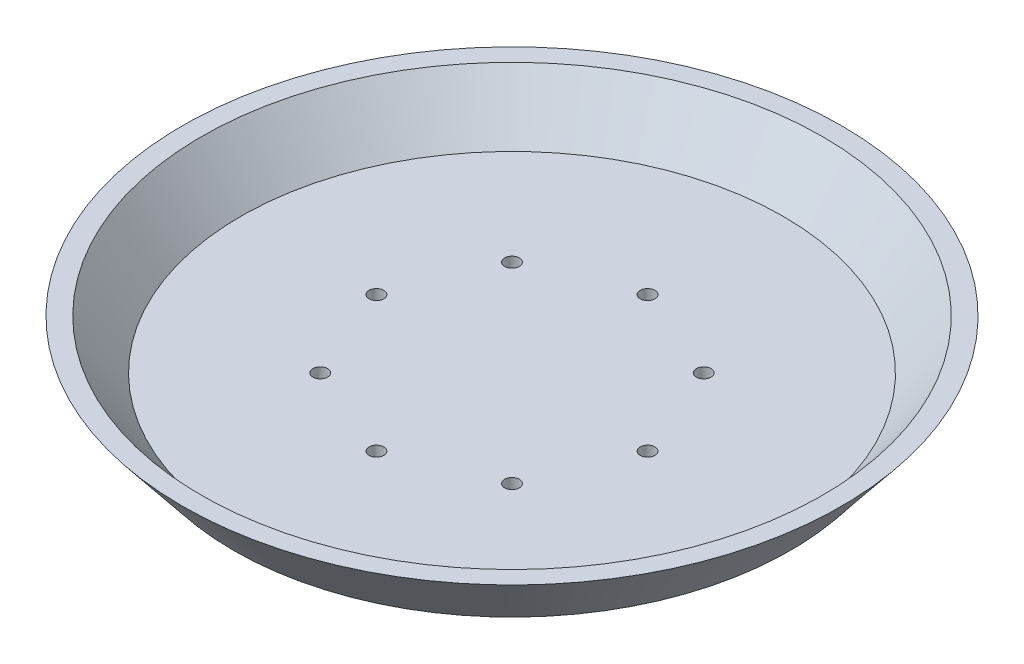
ISO-10303-21;
HEADER;
FILE_DESCRIPTION(('STEP AP214'),'2;1');
FILE_NAME('part.step','',(''),(''),'','','');
FILE_SCHEMA(('AUTOMOTIVE_DESIGN { 1 0 10303 214 1 1 1 1 }'));
ENDSEC;
DATA;
#1=APPLICATION_CONTEXT('core data for automotive mechanical design processes');
#2=APPLICATION_PROTOCOL_DEFINITION('international standard','automotive_design',2000,#1);
#3=PRODUCT_CONTEXT('',#1,'mechanical');
#4=PRODUCT('Part','Part','',(#3));
#5=PRODUCT_RELATED_PRODUCT_CATEGORY('part','',(#4));
#6=PRODUCT_DEFINITION_FORMATION('','',#4);
#7=PRODUCT_DEFINITION_CONTEXT('part definition',#1,'design');
#8=PRODUCT_DEFINITION('design','',#6,#7);
#9=PRODUCT_DEFINITION_SHAPE('','',#8);
#10=(LENGTH_UNIT() NAMED_UNIT(*) SI_UNIT(.MILLI.,.METRE.));
#11=(NAMED_UNIT(*) PLANE_ANGLE_UNIT() SI_UNIT($,.RADIAN.));
#12=(NAMED_UNIT(*) SI_UNIT($,.STERADIAN.) SOLID_ANGLE_UNIT());
#13=UNCERTAINTY_MEASURE_WITH_UNIT(LENGTH_MEASURE(1.E-05),#10,'distance_accuracy_value','');
#14=(GEOMETRIC_REPRESENTATION_CONTEXT(3) GLOBAL_UNCERTAINTY_ASSIGNED_CONTEXT((#13)) GLOBAL_UNIT_ASSIGNED_CONTEXT((#10,
#11,#12)) REPRESENTATION_CONTEXT('',''));
#15=CARTESIAN_POINT('',(0.,0.,0.));
#16=DIRECTION('',(0.,0.,1.));
#17=DIRECTION('',(1.,0.,0.));
#18=AXIS2_PLACEMENT_3D('',#15,#16,#17);
#19=CARTESIAN_POINT('',(0.,0.,0.));
#20=DIRECTION('',(0.,1.,0.));
#21=DIRECTION('',(0.,0.,1.));
#22=AXIS2_PLACEMENT_3D('',#19,#20,#21);
#23=PLANE('',#22);
#24=CARTESIAN_POINT('',(0.,0.,27.5));
#25=DIRECTION('',(0.,1.,0.));
#26=DIRECTION('',(0.,0.,1.));
#27=AXIS2_PLACEMENT_3D('',#24,#25,#26);
#28=CIRCLE('',#27,1.5);
#29=CARTESIAN_POINT('',(0.,0.,29.));
#30=VERTEX_POINT('',#29);
#31=EDGE_CURVE('E64',#30,#30,#28,.T.);
#32=ORIENTED_EDGE('',*,*,#31,.F.);
#33=EDGE_LOOP('',(#32));
#34=FACE_BOUND('',#33,.T.);
#35=CARTESIAN_POINT('',(19.4454364826301,0.,19.4454364826301));
#36=DIRECTION('',(0.,1.,0.));
#37=DIRECTION('',(0.,0.,1.));
#38=AXIS2_PLACEMENT_3D('',#35,#36,#37);
#39=CIRCLE('',#38,1.5);
#40=CARTESIAN_POINT('',(19.4454364826301,0.,20.9454364826301));
#41=VERTEX_POINT('',#40);
#42=EDGE_CURVE('E68',#41,#41,#39,.T.);
#43=ORIENTED_EDGE('',*,*,#42,.F.);
#44=EDGE_LOOP('',(#43));
#45=FACE_BOUND('',#44,.T.);
#46=CARTESIAN_POINT('',(27.5,0.,0.));
#47=DIRECTION('',(0.,1.,0.));
#48=DIRECTION('',(0.,0.,1.));
#49=AXIS2_PLACEMENT_3D('',#46,#47,#48);
#50=CIRCLE('',#49,1.5);
#51=CARTESIAN_POINT('',(27.5,0.,1.5));
#52=VERTEX_POINT('',#51);
#53=EDGE_CURVE('E72',#52,#52,#50,.T.);
#54=ORIENTED_EDGE('',*,*,#53,.F.);
#55=EDGE_LOOP('',(#54));
#56=FACE_BOUND('',#55,.T.);
#57=CARTESIAN_POINT('',(19.4454364826301,0.,-19.4454364826301));
#58=DIRECTION('',(0.,1.,0.));
#59=DIRECTION('',(0.,0.,1.));
#60=AXIS2_PLACEMENT_3D('',#57,#58,#59);
#61=CIRCLE('',#60,1.5);
#62=CARTESIAN_POINT('',(19.4454364826301,0.,-17.9454364826301));
#63=VERTEX_POINT('',#62);
#64=EDGE_CURVE('E76',#63,#63,#61,.T.);
#65=ORIENTED_EDGE('',*,*,#64,.F.);
#66=EDGE_LOOP('',(#65));
#67=FACE_BOUND('',#66,.T.);
#68=CARTESIAN_POINT('',(0.,0.,-27.5));
#69=DIRECTION('',(0.,1.,0.));
#70=DIRECTION('',(0.,0.,1.));
#71=AXIS2_PLACEMENT_3D('',#68,#69,#70);
#72=CIRCLE('',#71,1.5);
#73=CARTESIAN_POINT('',(0.,0.,-26.));
#74=VERTEX_POINT('',#73);
#75=EDGE_CURVE('E80',#74,#74,#72,.T.);
#76=ORIENTED_EDGE('',*,*,#75,.F.);
#77=EDGE_LOOP('',(#76));
#78=FACE_BOUND('',#77,.T.);
#79=CARTESIAN_POINT('',(-19.4454364826301,0.,-19.4454364826301));
#80=DIRECTION('',(0.,1.,0.));
#81=DIRECTION('',(0.,0.,1.));
#82=AXIS2_PLACEMENT_3D('',#79,#80,#81);
#83=CIRCLE('',#82,1.5);
#84=CARTESIAN_POINT('',(-19.4454364826301,0.,-17.9454364826301));
#85=VERTEX_POINT('',#84);
#86=EDGE_CURVE('E84',#85,#85,#83,.T.);
#87=ORIENTED_EDGE('',*,*,#86,.F.);
#88=EDGE_LOOP('',(#87));
#89=FACE_BOUND('',#88,.T.);
#90=CARTESIAN_POINT('',(-27.5,0.,0.));
#91=DIRECTION('',(0.,1.,0.));
#92=DIRECTION('',(0.,0.,1.));
#93=AXIS2_PLACEMENT_3D('',#90,#91,#92);
#94=CIRCLE('',#93,1.5);
#95=CARTESIAN_POINT('',(-27.5,0.,1.5));
#96=VERTEX_POINT('',#95);
#97=EDGE_CURVE('E88',#96,#96,#94,.T.);
#98=ORIENTED_EDGE('',*,*,#97,.F.);
#99=EDGE_LOOP('',(#98));
#100=FACE_BOUND('',#99,.T.);
#101=CARTESIAN_POINT('',(-19.4454364826301,0.,19.4454364826301));
#102=DIRECTION('',(0.,1.,0.));
#103=DIRECTION('',(0.,0.,1.));
#104=AXIS2_PLACEMENT_3D('',#101,#102,#103);
#105=CIRCLE('',#104,1.5);
#106=CARTESIAN_POINT('',(-19.4454364826301,0.,20.9454364826301));
#107=VERTEX_POINT('',#106);
#108=EDGE_CURVE('E92',#107,#107,#105,.T.);
#109=ORIENTED_EDGE('',*,*,#108,.F.);
#110=EDGE_LOOP('',(#109));
#111=FACE_BOUND('',#110,.T.);
#112=CARTESIAN_POINT('',(0.,0.,0.));
#113=DIRECTION('',(0.,-1.,0.));
#114=DIRECTION('',(0.,0.,-1.));
#115=AXIS2_PLACEMENT_3D('',#112,#113,#114);
#116=CIRCLE('',#115,55.);
#117=CARTESIAN_POINT('',(0.,0.,-55.));
#118=VERTEX_POINT('',#117);
#119=EDGE_CURVE('E58',#118,#118,#116,.T.);
#120=ORIENTED_EDGE('',*,*,#119,.F.);
#121=EDGE_LOOP('',(#120));
#122=FACE_BOUND('',#121,.T.);
#123=ADVANCED_FACE('F41',(#34,#45,#56,#67,#78,#89,#100,#111,#122),#23,.T.);
#124=CARTESIAN_POINT('',(56.4418745424597,-3.,0.));
#125=DIRECTION('',(0.,-1.,0.));
#126=DIRECTION('',(0.,0.,-1.));
#127=AXIS2_PLACEMENT_3D('',#124,#125,#126);
#128=PLANE('',#127);
#129=CARTESIAN_POINT('',(0.,-3.,27.5));
#130=DIRECTION('',(0.,-1.,0.));
#131=DIRECTION('',(0.,0.,-1.));
#132=AXIS2_PLACEMENT_3D('',#129,#130,#131);
#133=CIRCLE('',#132,1.5);
#134=CARTESIAN_POINT('',(0.,-3.,26.));
#135=VERTEX_POINT('',#134);
#136=EDGE_CURVE('E96',#135,#135,#133,.T.);
#137=ORIENTED_EDGE('',*,*,#136,.F.);
#138=EDGE_LOOP('',(#137));
#139=FACE_BOUND('',#138,.T.);
#140=CARTESIAN_POINT('',(19.4454364826301,-3.,19.4454364826301));
#141=DIRECTION('',(0.,-1.,0.));
#142=DIRECTION('',(0.,0.,-1.));
#143=AXIS2_PLACEMENT_3D('',#140,#141,#142);
#144=CIRCLE('',#143,1.5);
#145=CARTESIAN_POINT('',(19.4454364826301,-3.,17.9454364826301));
#146=VERTEX_POINT('',#145);
#147=EDGE_CURVE('E121',#146,#146,#144,.T.);
#148=ORIENTED_EDGE('',*,*,#147,.F.);
#149=EDGE_LOOP('',(#148));
#150=FACE_BOUND('',#149,.T.);
#151=CARTESIAN_POINT('',(27.5,-3.,0.));
#152=DIRECTION('',(0.,-1.,0.));
#153=DIRECTION('',(0.,0.,-1.));
#154=AXIS2_PLACEMENT_3D('',#151,#152,#153);
#155=CIRCLE('',#154,1.5);
#156=CARTESIAN_POINT('',(27.5,-3.,-1.5));
#157=VERTEX_POINT('',#156);
#158=EDGE_CURVE('E117',#157,#157,#155,.T.);
#159=ORIENTED_EDGE('',*,*,#158,.F.);
#160=EDGE_LOOP('',(#159));
#161=FACE_BOUND('',#160,.T.);
#162=CARTESIAN_POINT('',(19.4454364826301,-3.,-19.4454364826301));
#163=DIRECTION('',(0.,-1.,0.));
#164=DIRECTION('',(0.,0.,-1.));
#165=AXIS2_PLACEMENT_3D('',#162,#163,#164);
#166=CIRCLE('',#165,1.5);
#167=CARTESIAN_POINT('',(19.4454364826301,-3.,-20.9454364826301));
#168=VERTEX_POINT('',#167);
#169=EDGE_CURVE('E113',#168,#168,#166,.T.);
#170=ORIENTED_EDGE('',*,*,#169,.F.);
#171=EDGE_LOOP('',(#170));
#172=FACE_BOUND('',#171,.T.);
#173=CARTESIAN_POINT('',(0.,-3.,-27.5));
#174=DIRECTION('',(0.,-1.,0.));
#175=DIRECTION('',(0.,0.,-1.));
#176=AXIS2_PLACEMENT_3D('',#173,#174,#175);
#177=CIRCLE('',#176,1.5);
#178=CARTESIAN_POINT('',(0.,-3.,-29.));
#179=VERTEX_POINT('',#178);
#180=EDGE_CURVE('E109',#179,#179,#177,.T.);
#181=ORIENTED_EDGE('',*,*,#180,.F.);
#182=EDGE_LOOP('',(#181));
#183=FACE_BOUND('',#182,.T.);
#184=CARTESIAN_POINT('',(-19.4454364826301,-3.,-19.4454364826301));
#185=DIRECTION('',(0.,-1.,0.));
#186=DIRECTION('',(0.,0.,-1.));
#187=AXIS2_PLACEMENT_3D('',#184,#185,#186);
#188=CIRCLE('',#187,1.5);
#189=CARTESIAN_POINT('',(-19.4454364826301,-3.,-20.9454364826301));
#190=VERTEX_POINT('',#189);
#191=EDGE_CURVE('E105',#190,#190,#188,.T.);
#192=ORIENTED_EDGE('',*,*,#191,.F.);
#193=EDGE_LOOP('',(#192));
#194=FACE_BOUND('',#193,.T.);
#195=CARTESIAN_POINT('',(-27.5,-3.,0.));
#196=DIRECTION('',(0.,-1.,0.));
#197=DIRECTION('',(0.,0.,-1.));
#198=AXIS2_PLACEMENT_3D('',#195,#196,#197);
#199=CIRCLE('',#198,1.5);
#200=CARTESIAN_POINT('',(-27.5,-3.,-1.50000000000001));
#201=VERTEX_POINT('',#200);
#202=EDGE_CURVE('E101',#201,#201,#199,.T.);
#203=ORIENTED_EDGE('',*,*,#202,.F.);
#204=EDGE_LOOP('',(#203));
#205=FACE_BOUND('',#204,.T.);
#206=CARTESIAN_POINT('',(-19.4454364826301,-3.,19.4454364826301));
#207=DIRECTION('',(0.,-1.,0.));
#208=DIRECTION('',(0.,0.,-1.));
#209=AXIS2_PLACEMENT_3D('',#206,#207,#208);
#210=CIRCLE('',#209,1.5);
#211=CARTESIAN_POINT('',(-19.4454364826301,-3.,17.9454364826301));
#212=VERTEX_POINT('',#211);
#213=EDGE_CURVE('E97',#212,#212,#210,.T.);
#214=ORIENTED_EDGE('',*,*,#213,.F.);
#215=EDGE_LOOP('',(#214));
#216=FACE_BOUND('',#215,.T.);
#217=CARTESIAN_POINT('',(0.,-3.,0.));
#218=DIRECTION('',(0.,-1.,0.));
#219=DIRECTION('',(0.,0.,-1.));
#220=AXIS2_PLACEMENT_3D('',#217,#218,#219);
#221=CIRCLE('',#220,56.4418745424597);
#222=CARTESIAN_POINT('',(0.,-3.,-56.4418745424597));
#223=VERTEX_POINT('',#222);
#224=EDGE_CURVE('E10',#223,#223,#221,.T.);
#225=ORIENTED_EDGE('',*,*,#224,.T.);
#226=EDGE_LOOP('',(#225));
#227=FACE_BOUND('',#226,.T.);
#228=ADVANCED_FACE('F131',(#139,#150,#161,#172,#183,#194,#205,#216,#227),#128,.T.);
#229=CARTESIAN_POINT('',(0.,-3.,0.));
#230=DIRECTION('',(0.,1.,0.));
#231=DIRECTION('',(0.,0.,1.));
#232=AXIS2_PLACEMENT_3D('',#229,#230,#231);
#233=CONICAL_SURFACE('',#232,56.4418745424597,0.674740942223553);
#234=CARTESIAN_POINT('',(0.,10.,0.));
#235=DIRECTION('',(0.,-1.,0.));
#236=DIRECTION('',(0.,0.,-1.));
#237=AXIS2_PLACEMENT_3D('',#234,#235,#236);
#238=CIRCLE('',#237,66.8418745424597);
#239=CARTESIAN_POINT('',(0.,10.,-66.8418745424597));
#240=VERTEX_POINT('',#239);
#241=EDGE_CURVE('E48',#240,#240,#238,.T.);
#242=ORIENTED_EDGE('',*,*,#241,.T.);
#243=EDGE_LOOP('',(#242));
#244=FACE_BOUND('',#243,.T.);
#245=ORIENTED_EDGE('',*,*,#224,.F.);
#246=EDGE_LOOP('',(#245));
#247=FACE_BOUND('',#246,.T.);
#248=ADVANCED_FACE('F134',(#244,#247),#233,.T.);
#249=CARTESIAN_POINT('',(63.,10.,0.));
#250=DIRECTION('',(0.,1.,0.));
#251=DIRECTION('',(0.,0.,1.));
#252=AXIS2_PLACEMENT_3D('',#249,#250,#251);
#253=PLANE('',#252);
#254=CARTESIAN_POINT('',(0.,10.,0.));
#255=DIRECTION('',(0.,-1.,0.));
#256=DIRECTION('',(0.,0.,-1.));
#257=AXIS2_PLACEMENT_3D('',#254,#255,#256);
#258=CIRCLE('',#257,63.);
#259=CARTESIAN_POINT('',(0.,10.,-63.));
#260=VERTEX_POINT('',#259);
#261=EDGE_CURVE('E53',#260,#260,#258,.T.);
#262=ORIENTED_EDGE('',*,*,#261,.T.);
#263=EDGE_LOOP('',(#262));
#264=FACE_BOUND('',#263,.T.);
#265=ORIENTED_EDGE('',*,*,#241,.F.);
#266=EDGE_LOOP('',(#265));
#267=FACE_BOUND('',#266,.T.);
#268=ADVANCED_FACE('F162',(#264,#267),#253,.T.);
#269=CARTESIAN_POINT('',(0.,10.,0.));
#270=DIRECTION('',(0.,1.,0.));
#271=DIRECTION('',(0.,0.,1.));
#272=AXIS2_PLACEMENT_3D('',#269,#270,#271);
#273=CONICAL_SURFACE('',#272,63.,0.674740942223553);
#274=ORIENTED_EDGE('',*,*,#119,.T.);
#275=EDGE_LOOP('',(#274));
#276=FACE_BOUND('',#275,.T.);
#277=ORIENTED_EDGE('',*,*,#261,.F.);
#278=EDGE_LOOP('',(#277));
#279=FACE_BOUND('',#278,.T.);
#280=ADVANCED_FACE('F152',(#276,#279),#273,.F.);
#281=CARTESIAN_POINT('',(-19.4454364826301,10.,19.4454364826301));
#282=DIRECTION('',(0.,-1.,0.));
#283=DIRECTION('',(0.,0.,-1.));
#284=AXIS2_PLACEMENT_3D('',#281,#282,#283);
#285=CYLINDRICAL_SURFACE('',#284,1.5);
#286=ORIENTED_EDGE('',*,*,#108,.T.);
#287=EDGE_LOOP('',(#286));
#288=FACE_BOUND('',#287,.T.);
#289=ORIENTED_EDGE('',*,*,#213,.T.);
#290=EDGE_LOOP('',(#289));
#291=FACE_BOUND('',#290,.T.);
#292=ADVANCED_FACE('F149',(#288,#291),#285,.F.);
#293=CARTESIAN_POINT('',(-27.5,10.,0.));
#294=DIRECTION('',(0.,-1.,0.));
#295=DIRECTION('',(0.,0.,-1.));
#296=AXIS2_PLACEMENT_3D('',#293,#294,#295);
#297=CYLINDRICAL_SURFACE('',#296,1.5);
#298=ORIENTED_EDGE('',*,*,#97,.T.);
#299=EDGE_LOOP('',(#298));
#300=FACE_BOUND('',#299,.T.);
#301=ORIENTED_EDGE('',*,*,#202,.T.);
#302=EDGE_LOOP('',(#301));
#303=FACE_BOUND('',#302,.T.);
#304=ADVANCED_FACE('F151',(#300,#303),#297,.F.);
#305=CARTESIAN_POINT('',(-19.4454364826301,10.,-19.4454364826301));
#306=DIRECTION('',(0.,-1.,0.));
#307=DIRECTION('',(0.,0.,-1.));
#308=AXIS2_PLACEMENT_3D('',#305,#306,#307);
#309=CYLINDRICAL_SURFACE('',#308,1.5);
#310=ORIENTED_EDGE('',*,*,#86,.T.);
#311=EDGE_LOOP('',(#310));
#312=FACE_BOUND('',#311,.T.);
#313=ORIENTED_EDGE('',*,*,#191,.T.);
#314=EDGE_LOOP('',(#313));
#315=FACE_BOUND('',#314,.T.);
#316=ADVANCED_FACE('F159',(#312,#315),#309,.F.);
#317=CARTESIAN_POINT('',(0.,10.,-27.5));
#318=DIRECTION('',(0.,-1.,0.));
#319=DIRECTION('',(0.,0.,-1.));
#320=AXIS2_PLACEMENT_3D('',#317,#318,#319);
#321=CYLINDRICAL_SURFACE('',#320,1.5);
#322=ORIENTED_EDGE('',*,*,#75,.T.);
#323=EDGE_LOOP('',(#322));
#324=FACE_BOUND('',#323,.T.);
#325=ORIENTED_EDGE('',*,*,#180,.T.);
#326=EDGE_LOOP('',(#325));
#327=FACE_BOUND('',#326,.T.);
#328=ADVANCED_FACE('F229',(#324,#327),#321,.F.);
#329=CARTESIAN_POINT('',(19.4454364826301,10.,-19.4454364826301));
#330=DIRECTION('',(0.,-1.,0.));
#331=DIRECTION('',(0.,0.,-1.));
#332=AXIS2_PLACEMENT_3D('',#329,#330,#331);
#333=CYLINDRICAL_SURFACE('',#332,1.5);
#334=ORIENTED_EDGE('',*,*,#64,.T.);
#335=EDGE_LOOP('',(#334));
#336=FACE_BOUND('',#335,.T.);
#337=ORIENTED_EDGE('',*,*,#169,.T.);
#338=EDGE_LOOP('',(#337));
#339=FACE_BOUND('',#338,.T.);
#340=ADVANCED_FACE('F240',(#336,#339),#333,.F.);
#341=CARTESIAN_POINT('',(27.5,10.,0.));
#342=DIRECTION('',(0.,-1.,0.));
#343=DIRECTION('',(0.,0.,-1.));
#344=AXIS2_PLACEMENT_3D('',#341,#342,#343);
#345=CYLINDRICAL_SURFACE('',#344,1.5);
#346=ORIENTED_EDGE('',*,*,#53,.T.);
#347=EDGE_LOOP('',(#346));
#348=FACE_BOUND('',#347,.T.);
#349=ORIENTED_EDGE('',*,*,#158,.T.);
#350=EDGE_LOOP('',(#349));
#351=FACE_BOUND('',#350,.T.);
#352=ADVANCED_FACE('F251',(#348,#351),#345,.F.);
#353=CARTESIAN_POINT('',(19.4454364826301,10.,19.4454364826301));
#354=DIRECTION('',(0.,-1.,0.));
#355=DIRECTION('',(0.,0.,-1.));
#356=AXIS2_PLACEMENT_3D('',#353,#354,#355);
#357=CYLINDRICAL_SURFACE('',#356,1.5);
#358=ORIENTED_EDGE('',*,*,#42,.T.);
#359=EDGE_LOOP('',(#358));
#360=FACE_BOUND('',#359,.T.);
#361=ORIENTED_EDGE('',*,*,#147,.T.);
#362=EDGE_LOOP('',(#361));
#363=FACE_BOUND('',#362,.T.);
#364=ADVANCED_FACE('F262',(#360,#363),#357,.F.);
#365=CARTESIAN_POINT('',(0.,10.,27.5));
#366=DIRECTION('',(0.,-1.,0.));
#367=DIRECTION('',(0.,0.,-1.));
#368=AXIS2_PLACEMENT_3D('',#365,#366,#367);
#369=CYLINDRICAL_SURFACE('',#368,1.5);
#370=ORIENTED_EDGE('',*,*,#31,.T.);
#371=EDGE_LOOP('',(#370));
#372=FACE_BOUND('',#371,.T.);
#373=ORIENTED_EDGE('',*,*,#136,.T.);
#374=EDGE_LOOP('',(#373));
#375=FACE_BOUND('',#374,.T.);
#376=ADVANCED_FACE('F129',(#372,#375),#369,.F.);
#377=CLOSED_SHELL('',(#123,#228,#248,#268,#280,#292,#304,#316,#328,#340,#352,#364,#376));
#378=MANIFOLD_SOLID_BREP('B2',#377);
#379=ADVANCED_BREP_SHAPE_REPRESENTATION('',(#18,#378),#14);
#380=SHAPE_DEFINITION_REPRESENTATION(#9,#379);
ENDSEC;
END-ISO-10303-21;
